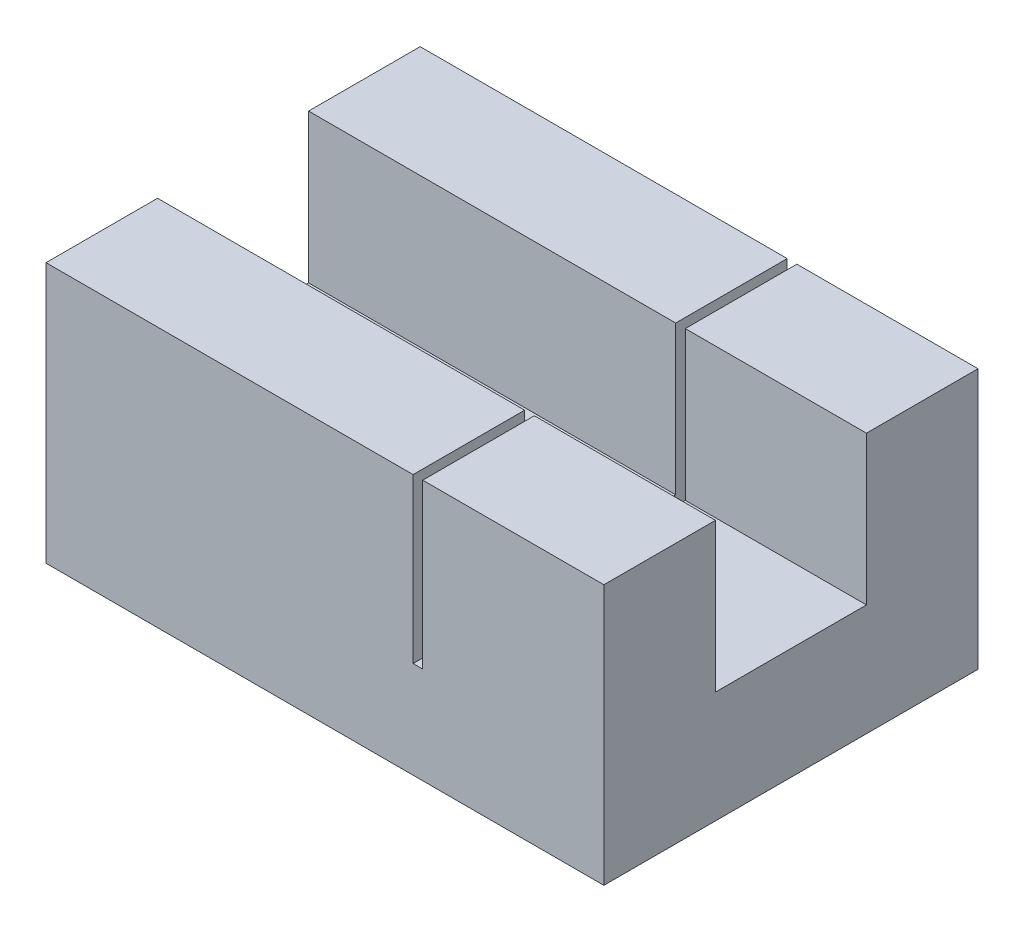
ISO-10303-21;
HEADER;
FILE_DESCRIPTION(('STEP AP214'),'2;1');
FILE_NAME('part.step','',(''),(''),'','','');
FILE_SCHEMA(('AUTOMOTIVE_DESIGN { 1 0 10303 214 1 1 1 1 }'));
ENDSEC;
DATA;
#1=APPLICATION_CONTEXT('core data for automotive mechanical design processes');
#2=APPLICATION_PROTOCOL_DEFINITION('international standard','automotive_design',2000,#1);
#3=PRODUCT_CONTEXT('',#1,'mechanical');
#4=PRODUCT('Part','Part','',(#3));
#5=PRODUCT_RELATED_PRODUCT_CATEGORY('part','',(#4));
#6=PRODUCT_DEFINITION_FORMATION('','',#4);
#7=PRODUCT_DEFINITION_CONTEXT('part definition',#1,'design');
#8=PRODUCT_DEFINITION('design','',#6,#7);
#9=PRODUCT_DEFINITION_SHAPE('','',#8);
#10=(LENGTH_UNIT() NAMED_UNIT(*) SI_UNIT(.MILLI.,.METRE.));
#11=(NAMED_UNIT(*) PLANE_ANGLE_UNIT() SI_UNIT($,.RADIAN.));
#12=(NAMED_UNIT(*) SI_UNIT($,.STERADIAN.) SOLID_ANGLE_UNIT());
#13=UNCERTAINTY_MEASURE_WITH_UNIT(LENGTH_MEASURE(1.E-05),#10,'distance_accuracy_value','');
#14=(GEOMETRIC_REPRESENTATION_CONTEXT(3) GLOBAL_UNCERTAINTY_ASSIGNED_CONTEXT((#13)) GLOBAL_UNIT_ASSIGNED_CONTEXT((#10,
#11,#12)) REPRESENTATION_CONTEXT('',''));
#15=CARTESIAN_POINT('',(0.,0.,0.));
#16=DIRECTION('',(0.,0.,1.));
#17=DIRECTION('',(1.,0.,0.));
#18=AXIS2_PLACEMENT_3D('',#15,#16,#17);
#19=CARTESIAN_POINT('',(0.,15.,0.));
#20=DIRECTION('',(0.,-1.,0.));
#21=DIRECTION('',(0.,0.,-1.));
#22=AXIS2_PLACEMENT_3D('',#19,#20,#21);
#23=PLANE('',#22);
#24=DIRECTION('',(-1.,0.,0.));
#25=VECTOR('',#24,1.);
#26=CARTESIAN_POINT('',(0.,15.,-20.3));
#27=LINE('',#26,#25);
#28=CARTESIAN_POINT('',(50.,15.,-20.3));
#29=VERTEX_POINT('',#28);
#30=CARTESIAN_POINT('',(25.65,15.,-20.3));
#31=VERTEX_POINT('',#30);
#32=EDGE_CURVE('E12',#29,#31,#27,.T.);
#33=ORIENTED_EDGE('',*,*,#32,.T.);
#34=DIRECTION('',(0.,0.,1.));
#35=VECTOR('',#34,1.);
#36=CARTESIAN_POINT('',(25.65,15.,0.));
#37=LINE('',#36,#35);
#38=CARTESIAN_POINT('',(25.65,15.,0.));
#39=VERTEX_POINT('',#38);
#40=EDGE_CURVE('E258',#31,#39,#37,.T.);
#41=ORIENTED_EDGE('',*,*,#40,.T.);
#42=DIRECTION('',(1.,0.,0.));
#43=VECTOR('',#42,1.);
#44=CARTESIAN_POINT('',(0.,15.,0.));
#45=LINE('',#44,#43);
#46=CARTESIAN_POINT('',(50.,15.,0.));
#47=VERTEX_POINT('',#46);
#48=EDGE_CURVE('E66',#39,#47,#45,.T.);
#49=ORIENTED_EDGE('',*,*,#48,.T.);
#50=DIRECTION('',(0.,0.,-1.));
#51=VECTOR('',#50,1.);
#52=CARTESIAN_POINT('',(50.,15.,0.));
#53=LINE('',#52,#51);
#54=EDGE_CURVE('E308',#47,#29,#53,.T.);
#55=ORIENTED_EDGE('',*,*,#54,.T.);
#56=EDGE_LOOP('',(#33,#41,#49,#55));
#57=FACE_BOUND('',#56,.T.);
#58=ADVANCED_FACE('F41',(#57),#23,.F.);
#59=CARTESIAN_POINT('',(0.,0.,0.));
#60=DIRECTION('',(0.,0.,-1.));
#61=DIRECTION('',(-1.,0.,0.));
#62=AXIS2_PLACEMENT_3D('',#59,#60,#61);
#63=PLANE('',#62);
#64=DIRECTION('',(0.,-1.,0.));
#65=VECTOR('',#64,1.);
#66=CARTESIAN_POINT('',(25.65,0.,0.));
#67=LINE('',#66,#65);
#68=CARTESIAN_POINT('',(25.65,35.,0.));
#69=VERTEX_POINT('',#68);
#70=EDGE_CURVE('E261',#69,#39,#67,.T.);
#71=ORIENTED_EDGE('',*,*,#70,.F.);
#72=DIRECTION('',(-1.,0.,0.));
#73=VECTOR('',#72,1.);
#74=CARTESIAN_POINT('',(0.,35.,0.));
#75=LINE('',#74,#73);
#76=CARTESIAN_POINT('',(50.,35.,0.));
#77=VERTEX_POINT('',#76);
#78=EDGE_CURVE('E286',#77,#69,#75,.T.);
#79=ORIENTED_EDGE('',*,*,#78,.F.);
#80=DIRECTION('',(0.,1.,0.));
#81=VECTOR('',#80,1.);
#82=CARTESIAN_POINT('',(50.,0.,0.));
#83=LINE('',#82,#81);
#84=EDGE_CURVE('E282',#47,#77,#83,.T.);
#85=ORIENTED_EDGE('',*,*,#84,.F.);
#86=ORIENTED_EDGE('',*,*,#48,.F.);
#87=EDGE_LOOP('',(#71,#79,#85,#86));
#88=FACE_BOUND('',#87,.T.);
#89=ADVANCED_FACE('F357',(#88),#63,.T.);
#90=CARTESIAN_POINT('',(0.,35.,15.));
#91=DIRECTION('',(0.,-1.,0.));
#92=DIRECTION('',(0.,0.,-1.));
#93=AXIS2_PLACEMENT_3D('',#90,#91,#92);
#94=PLANE('',#93);
#95=ORIENTED_EDGE('',*,*,#78,.T.);
#96=DIRECTION('',(0.,0.,-1.));
#97=VECTOR('',#96,1.);
#98=CARTESIAN_POINT('',(25.65,35.,-35.3));
#99=LINE('',#98,#97);
#100=CARTESIAN_POINT('',(25.65,35.,15.));
#101=VERTEX_POINT('',#100);
#102=EDGE_CURVE('E212',#101,#69,#99,.T.);
#103=ORIENTED_EDGE('',*,*,#102,.F.);
#104=DIRECTION('',(-1.,0.,0.));
#105=VECTOR('',#104,1.);
#106=CARTESIAN_POINT('',(0.,35.,15.));
#107=LINE('',#106,#105);
#108=CARTESIAN_POINT('',(50.,35.,15.));
#109=VERTEX_POINT('',#108);
#110=EDGE_CURVE('E290',#109,#101,#107,.T.);
#111=ORIENTED_EDGE('',*,*,#110,.F.);
#112=DIRECTION('',(0.,0.,-1.));
#113=VECTOR('',#112,1.);
#114=CARTESIAN_POINT('',(50.,35.,15.));
#115=LINE('',#114,#113);
#116=EDGE_CURVE('E294',#109,#77,#115,.T.);
#117=ORIENTED_EDGE('',*,*,#116,.T.);
#118=EDGE_LOOP('',(#95,#103,#111,#117));
#119=FACE_BOUND('',#118,.T.);
#120=ADVANCED_FACE('F353',(#119),#94,.F.);
#121=CARTESIAN_POINT('',(0.,0.,-20.3));
#122=DIRECTION('',(0.,0.,1.));
#123=DIRECTION('',(-1.,0.,0.));
#124=AXIS2_PLACEMENT_3D('',#121,#122,#123);
#125=PLANE('',#124);
#126=DIRECTION('',(0.,1.,0.));
#127=VECTOR('',#126,1.);
#128=CARTESIAN_POINT('',(25.65,0.,-20.3));
#129=LINE('',#128,#127);
#130=CARTESIAN_POINT('',(25.65,35.,-20.3));
#131=VERTEX_POINT('',#130);
#132=EDGE_CURVE('E255',#31,#131,#129,.T.);
#133=ORIENTED_EDGE('',*,*,#132,.F.);
#134=ORIENTED_EDGE('',*,*,#32,.F.);
#135=DIRECTION('',(0.,1.,0.));
#136=VECTOR('',#135,1.);
#137=CARTESIAN_POINT('',(50.,0.,-20.3));
#138=LINE('',#137,#136);
#139=CARTESIAN_POINT('',(50.,35.,-20.3));
#140=VERTEX_POINT('',#139);
#141=EDGE_CURVE('E276',#29,#140,#138,.T.);
#142=ORIENTED_EDGE('',*,*,#141,.T.);
#143=DIRECTION('',(-1.,0.,0.));
#144=VECTOR('',#143,1.);
#145=CARTESIAN_POINT('',(0.,35.,-20.3));
#146=LINE('',#145,#144);
#147=EDGE_CURVE('E272',#140,#131,#146,.T.);
#148=ORIENTED_EDGE('',*,*,#147,.T.);
#149=EDGE_LOOP('',(#133,#134,#142,#148));
#150=FACE_BOUND('',#149,.T.);
#151=ADVANCED_FACE('F361',(#150),#125,.T.);
#152=CARTESIAN_POINT('',(0.,35.,-35.3));
#153=DIRECTION('',(0.,1.,0.));
#154=DIRECTION('',(0.,0.,1.));
#155=AXIS2_PLACEMENT_3D('',#152,#153,#154);
#156=PLANE('',#155);
#157=CARTESIAN_POINT('',(25.65,35.,-35.3));
#158=VERTEX_POINT('',#157);
#159=EDGE_CURVE('E216',#131,#158,#99,.T.);
#160=ORIENTED_EDGE('',*,*,#159,.F.);
#161=ORIENTED_EDGE('',*,*,#147,.F.);
#162=DIRECTION('',(0.,0.,1.));
#163=VECTOR('',#162,1.);
#164=CARTESIAN_POINT('',(50.,35.,-35.3));
#165=LINE('',#164,#163);
#166=CARTESIAN_POINT('',(50.,35.,-35.3));
#167=VERTEX_POINT('',#166);
#168=EDGE_CURVE('E171',#167,#140,#165,.T.);
#169=ORIENTED_EDGE('',*,*,#168,.F.);
#170=DIRECTION('',(-1.,0.,0.));
#171=VECTOR('',#170,1.);
#172=CARTESIAN_POINT('',(0.,35.,-35.3));
#173=LINE('',#172,#171);
#174=EDGE_CURVE('E265',#167,#158,#173,.T.);
#175=ORIENTED_EDGE('',*,*,#174,.T.);
#176=EDGE_LOOP('',(#160,#161,#169,#175));
#177=FACE_BOUND('',#176,.T.);
#178=ADVANCED_FACE('F366',(#177),#156,.T.);
#179=CARTESIAN_POINT('',(50.,15.,0.));
#180=DIRECTION('',(-1.,0.,0.));
#181=DIRECTION('',(0.,0.,1.));
#182=AXIS2_PLACEMENT_3D('',#179,#180,#181);
#183=PLANE('',#182);
#184=DIRECTION('',(0.,0.,-1.));
#185=VECTOR('',#184,1.);
#186=CARTESIAN_POINT('',(50.,0.,0.));
#187=LINE('',#186,#185);
#188=CARTESIAN_POINT('',(50.,0.,15.));
#189=VERTEX_POINT('',#188);
#190=CARTESIAN_POINT('',(50.,0.,-35.3));
#191=VERTEX_POINT('',#190);
#192=EDGE_CURVE('E45',#189,#191,#187,.T.);
#193=ORIENTED_EDGE('',*,*,#192,.T.);
#194=DIRECTION('',(0.,1.,0.));
#195=VECTOR('',#194,1.);
#196=CARTESIAN_POINT('',(50.,0.,-35.3));
#197=LINE('',#196,#195);
#198=EDGE_CURVE('E168',#191,#167,#197,.T.);
#199=ORIENTED_EDGE('',*,*,#198,.T.);
#200=ORIENTED_EDGE('',*,*,#168,.T.);
#201=ORIENTED_EDGE('',*,*,#141,.F.);
#202=ORIENTED_EDGE('',*,*,#54,.F.);
#203=ORIENTED_EDGE('',*,*,#84,.T.);
#204=ORIENTED_EDGE('',*,*,#116,.F.);
#205=DIRECTION('',(0.,1.,0.));
#206=VECTOR('',#205,1.);
#207=CARTESIAN_POINT('',(50.,0.,15.));
#208=LINE('',#207,#206);
#209=EDGE_CURVE('E285',#189,#109,#208,.T.);
#210=ORIENTED_EDGE('',*,*,#209,.F.);
#211=EDGE_LOOP('',(#193,#199,#200,#201,#202,#203,#204,#210));
#212=FACE_BOUND('',#211,.T.);
#213=ADVANCED_FACE('F43',(#212),#183,.F.);
#214=CARTESIAN_POINT('',(-25.,15.,0.));
#215=VERTEX_POINT('',#214);
#216=CARTESIAN_POINT('',(24.35,15.,0.));
#217=VERTEX_POINT('',#216);
#218=EDGE_CURVE('E304',#215,#217,#45,.T.);
#219=ORIENTED_EDGE('',*,*,#218,.T.);
#220=DIRECTION('',(0.,0.,-1.));
#221=VECTOR('',#220,1.);
#222=CARTESIAN_POINT('',(24.35,15.,0.));
#223=LINE('',#222,#221);
#224=CARTESIAN_POINT('',(24.35,15.,-20.3));
#225=VERTEX_POINT('',#224);
#226=EDGE_CURVE('E248',#217,#225,#223,.T.);
#227=ORIENTED_EDGE('',*,*,#226,.T.);
#228=CARTESIAN_POINT('',(-25.,15.,-20.3));
#229=VERTEX_POINT('',#228);
#230=EDGE_CURVE('E51',#225,#229,#27,.T.);
#231=ORIENTED_EDGE('',*,*,#230,.T.);
#232=DIRECTION('',(0.,0.,-1.));
#233=VECTOR('',#232,1.);
#234=CARTESIAN_POINT('',(-25.,15.,0.));
#235=LINE('',#234,#233);
#236=EDGE_CURVE('E202',#215,#229,#235,.T.);
#237=ORIENTED_EDGE('',*,*,#236,.F.);
#238=EDGE_LOOP('',(#219,#227,#231,#237));
#239=FACE_BOUND('',#238,.T.);
#240=ADVANCED_FACE('F315',(#239),#23,.F.);
#241=CARTESIAN_POINT('',(0.,0.,0.));
#242=DIRECTION('',(0.,-1.,0.));
#243=DIRECTION('',(0.,0.,-1.));
#244=AXIS2_PLACEMENT_3D('',#241,#242,#243);
#245=PLANE('',#244);
#246=DIRECTION('',(1.,0.,0.));
#247=VECTOR('',#246,1.);
#248=CARTESIAN_POINT('',(0.,0.,15.));
#249=LINE('',#248,#247);
#250=CARTESIAN_POINT('',(-25.,0.,15.));
#251=VERTEX_POINT('',#250);
#252=EDGE_CURVE('E177',#251,#189,#249,.T.);
#253=ORIENTED_EDGE('',*,*,#252,.F.);
#254=DIRECTION('',(0.,0.,1.));
#255=VECTOR('',#254,1.);
#256=CARTESIAN_POINT('',(-25.,0.,-35.3));
#257=LINE('',#256,#255);
#258=CARTESIAN_POINT('',(-25.,0.,-35.3));
#259=VERTEX_POINT('',#258);
#260=EDGE_CURVE('E174',#259,#251,#257,.T.);
#261=ORIENTED_EDGE('',*,*,#260,.F.);
#262=DIRECTION('',(1.,0.,0.));
#263=VECTOR('',#262,1.);
#264=CARTESIAN_POINT('',(0.,0.,-35.3));
#265=LINE('',#264,#263);
#266=EDGE_CURVE('E160',#259,#191,#265,.T.);
#267=ORIENTED_EDGE('',*,*,#266,.T.);
#268=ORIENTED_EDGE('',*,*,#192,.F.);
#269=EDGE_LOOP('',(#253,#261,#267,#268));
#270=FACE_BOUND('',#269,.T.);
#271=ADVANCED_FACE('F175',(#270),#245,.T.);
#272=DIRECTION('',(0.,1.,0.));
#273=VECTOR('',#272,1.);
#274=CARTESIAN_POINT('',(24.35,0.,0.));
#275=LINE('',#274,#273);
#276=CARTESIAN_POINT('',(24.35,35.,0.));
#277=VERTEX_POINT('',#276);
#278=EDGE_CURVE('E252',#217,#277,#275,.T.);
#279=ORIENTED_EDGE('',*,*,#278,.F.);
#280=ORIENTED_EDGE('',*,*,#218,.F.);
#281=DIRECTION('',(0.,-1.,0.));
#282=VECTOR('',#281,1.);
#283=CARTESIAN_POINT('',(-25.,35.,0.));
#284=LINE('',#283,#282);
#285=CARTESIAN_POINT('',(-25.,35.,0.));
#286=VERTEX_POINT('',#285);
#287=EDGE_CURVE('E198',#286,#215,#284,.T.);
#288=ORIENTED_EDGE('',*,*,#287,.F.);
#289=EDGE_CURVE('E297',#277,#286,#75,.T.);
#290=ORIENTED_EDGE('',*,*,#289,.F.);
#291=EDGE_LOOP('',(#279,#280,#288,#290));
#292=FACE_BOUND('',#291,.T.);
#293=ADVANCED_FACE('F382',(#292),#63,.T.);
#294=CARTESIAN_POINT('',(24.35,35.,15.));
#295=VERTEX_POINT('',#294);
#296=CARTESIAN_POINT('',(-25.,35.,15.));
#297=VERTEX_POINT('',#296);
#298=EDGE_CURVE('E289',#295,#297,#107,.T.);
#299=ORIENTED_EDGE('',*,*,#298,.F.);
#300=DIRECTION('',(0.,0.,1.));
#301=VECTOR('',#300,1.);
#302=CARTESIAN_POINT('',(24.35,35.,-35.3));
#303=LINE('',#302,#301);
#304=EDGE_CURVE('E211',#277,#295,#303,.T.);
#305=ORIENTED_EDGE('',*,*,#304,.F.);
#306=ORIENTED_EDGE('',*,*,#289,.T.);
#307=DIRECTION('',(0.,0.,-1.));
#308=VECTOR('',#307,1.);
#309=CARTESIAN_POINT('',(-25.,35.,15.));
#310=LINE('',#309,#308);
#311=EDGE_CURVE('E194',#297,#286,#310,.T.);
#312=ORIENTED_EDGE('',*,*,#311,.F.);
#313=EDGE_LOOP('',(#299,#305,#306,#312));
#314=FACE_BOUND('',#313,.T.);
#315=ADVANCED_FACE('F340',(#314),#94,.F.);
#316=CARTESIAN_POINT('',(0.,0.,15.));
#317=DIRECTION('',(0.,0.,-1.));
#318=DIRECTION('',(-1.,0.,0.));
#319=AXIS2_PLACEMENT_3D('',#316,#317,#318);
#320=PLANE('',#319);
#321=ORIENTED_EDGE('',*,*,#110,.T.);
#322=DIRECTION('',(0.,1.,0.));
#323=VECTOR('',#322,1.);
#324=CARTESIAN_POINT('',(25.65,-50.3167964004069,15.));
#325=LINE('',#324,#323);
#326=CARTESIAN_POINT('',(25.65,13.,15.));
#327=VERTEX_POINT('',#326);
#328=EDGE_CURVE('E223',#327,#101,#325,.T.);
#329=ORIENTED_EDGE('',*,*,#328,.F.);
#330=DIRECTION('',(1.,0.,0.));
#331=VECTOR('',#330,1.);
#332=CARTESIAN_POINT('',(24.35,13.,15.));
#333=LINE('',#332,#331);
#334=CARTESIAN_POINT('',(24.35,13.,15.));
#335=VERTEX_POINT('',#334);
#336=EDGE_CURVE('E215',#335,#327,#333,.T.);
#337=ORIENTED_EDGE('',*,*,#336,.F.);
#338=DIRECTION('',(0.,1.,0.));
#339=VECTOR('',#338,1.);
#340=CARTESIAN_POINT('',(24.35,-50.3167964004069,15.));
#341=LINE('',#340,#339);
#342=EDGE_CURVE('E227',#335,#295,#341,.T.);
#343=ORIENTED_EDGE('',*,*,#342,.T.);
#344=ORIENTED_EDGE('',*,*,#298,.T.);
#345=DIRECTION('',(0.,1.,0.));
#346=VECTOR('',#345,1.);
#347=CARTESIAN_POINT('',(-25.,0.,15.));
#348=LINE('',#347,#346);
#349=EDGE_CURVE('E182',#251,#297,#348,.T.);
#350=ORIENTED_EDGE('',*,*,#349,.F.);
#351=ORIENTED_EDGE('',*,*,#252,.T.);
#352=ORIENTED_EDGE('',*,*,#209,.T.);
#353=EDGE_LOOP('',(#321,#329,#337,#343,#344,#350,#351,#352));
#354=FACE_BOUND('',#353,.T.);
#355=ADVANCED_FACE('F337',(#354),#320,.F.);
#356=DIRECTION('',(0.,-1.,0.));
#357=VECTOR('',#356,1.);
#358=CARTESIAN_POINT('',(24.35,0.,-20.3));
#359=LINE('',#358,#357);
#360=CARTESIAN_POINT('',(24.35,35.,-20.3));
#361=VERTEX_POINT('',#360);
#362=EDGE_CURVE('E245',#361,#225,#359,.T.);
#363=ORIENTED_EDGE('',*,*,#362,.F.);
#364=CARTESIAN_POINT('',(-25.,35.,-20.3));
#365=VERTEX_POINT('',#364);
#366=EDGE_CURVE('E264',#361,#365,#146,.T.);
#367=ORIENTED_EDGE('',*,*,#366,.T.);
#368=DIRECTION('',(0.,1.,0.));
#369=VECTOR('',#368,1.);
#370=CARTESIAN_POINT('',(-25.,15.,-20.3));
#371=LINE('',#370,#369);
#372=EDGE_CURVE('E206',#229,#365,#371,.T.);
#373=ORIENTED_EDGE('',*,*,#372,.F.);
#374=ORIENTED_EDGE('',*,*,#230,.F.);
#375=EDGE_LOOP('',(#363,#367,#373,#374));
#376=FACE_BOUND('',#375,.T.);
#377=ADVANCED_FACE('F320',(#376),#125,.T.);
#378=CARTESIAN_POINT('',(24.35,35.,-35.3));
#379=VERTEX_POINT('',#378);
#380=EDGE_CURVE('E217',#379,#361,#303,.T.);
#381=ORIENTED_EDGE('',*,*,#380,.F.);
#382=CARTESIAN_POINT('',(-25.,35.,-35.3));
#383=VERTEX_POINT('',#382);
#384=EDGE_CURVE('E269',#379,#383,#173,.T.);
#385=ORIENTED_EDGE('',*,*,#384,.T.);
#386=DIRECTION('',(0.,0.,-1.));
#387=VECTOR('',#386,1.);
#388=CARTESIAN_POINT('',(-25.,35.,-20.3));
#389=LINE('',#388,#387);
#390=EDGE_CURVE('E188',#365,#383,#389,.T.);
#391=ORIENTED_EDGE('',*,*,#390,.F.);
#392=ORIENTED_EDGE('',*,*,#366,.F.);
#393=EDGE_LOOP('',(#381,#385,#391,#392));
#394=FACE_BOUND('',#393,.T.);
#395=ADVANCED_FACE('F344',(#394),#156,.T.);
#396=CARTESIAN_POINT('',(0.,0.,-35.3));
#397=DIRECTION('',(0.,0.,1.));
#398=DIRECTION('',(-1.,0.,0.));
#399=AXIS2_PLACEMENT_3D('',#396,#397,#398);
#400=PLANE('',#399);
#401=DIRECTION('',(-1.,0.,0.));
#402=VECTOR('',#401,1.);
#403=CARTESIAN_POINT('',(24.35,13.,-35.3));
#404=LINE('',#403,#402);
#405=CARTESIAN_POINT('',(25.65,13.,-35.3));
#406=VERTEX_POINT('',#405);
#407=CARTESIAN_POINT('',(24.35,13.,-35.3));
#408=VERTEX_POINT('',#407);
#409=EDGE_CURVE('E58',#406,#408,#404,.T.);
#410=ORIENTED_EDGE('',*,*,#409,.F.);
#411=DIRECTION('',(0.,1.,0.));
#412=VECTOR('',#411,1.);
#413=CARTESIAN_POINT('',(25.65,-50.3167964004069,-35.3));
#414=LINE('',#413,#412);
#415=EDGE_CURVE('E231',#406,#158,#414,.T.);
#416=ORIENTED_EDGE('',*,*,#415,.T.);
#417=ORIENTED_EDGE('',*,*,#174,.F.);
#418=ORIENTED_EDGE('',*,*,#198,.F.);
#419=ORIENTED_EDGE('',*,*,#266,.F.);
#420=DIRECTION('',(0.,-1.,0.));
#421=VECTOR('',#420,1.);
#422=CARTESIAN_POINT('',(-25.,35.,-35.3));
#423=LINE('',#422,#421);
#424=EDGE_CURVE('E165',#383,#259,#423,.T.);
#425=ORIENTED_EDGE('',*,*,#424,.F.);
#426=ORIENTED_EDGE('',*,*,#384,.F.);
#427=DIRECTION('',(0.,1.,0.));
#428=VECTOR('',#427,1.);
#429=CARTESIAN_POINT('',(24.35,-50.3167964004069,-35.3));
#430=LINE('',#429,#428);
#431=EDGE_CURVE('E228',#408,#379,#430,.T.);
#432=ORIENTED_EDGE('',*,*,#431,.F.);
#433=EDGE_LOOP('',(#410,#416,#417,#418,#419,#425,#426,#432));
#434=FACE_BOUND('',#433,.T.);
#435=ADVANCED_FACE('F162',(#434),#400,.F.);
#436=CARTESIAN_POINT('',(0.,13.,0.));
#437=DIRECTION('',(0.,-1.,0.));
#438=DIRECTION('',(0.,0.,-1.));
#439=AXIS2_PLACEMENT_3D('',#436,#437,#438);
#440=PLANE('',#439);
#441=DIRECTION('',(0.,0.,1.));
#442=VECTOR('',#441,1.);
#443=CARTESIAN_POINT('',(24.35,13.,-35.3));
#444=LINE('',#443,#442);
#445=EDGE_CURVE('E224',#408,#335,#444,.T.);
#446=ORIENTED_EDGE('',*,*,#445,.T.);
#447=ORIENTED_EDGE('',*,*,#336,.T.);
#448=DIRECTION('',(0.,0.,-1.));
#449=VECTOR('',#448,1.);
#450=CARTESIAN_POINT('',(25.65,13.,-35.3));
#451=LINE('',#450,#449);
#452=EDGE_CURVE('E232',#327,#406,#451,.T.);
#453=ORIENTED_EDGE('',*,*,#452,.T.);
#454=ORIENTED_EDGE('',*,*,#409,.T.);
#455=EDGE_LOOP('',(#446,#447,#453,#454));
#456=FACE_BOUND('',#455,.T.);
#457=ADVANCED_FACE('F346',(#456),#440,.F.);
#458=CARTESIAN_POINT('',(25.65,-50.3167964004069,-35.3));
#459=DIRECTION('',(1.,0.,0.));
#460=DIRECTION('',(0.,0.,-1.));
#461=AXIS2_PLACEMENT_3D('',#458,#459,#460);
#462=PLANE('',#461);
#463=ORIENTED_EDGE('',*,*,#70,.T.);
#464=ORIENTED_EDGE('',*,*,#40,.F.);
#465=ORIENTED_EDGE('',*,*,#132,.T.);
#466=ORIENTED_EDGE('',*,*,#159,.T.);
#467=ORIENTED_EDGE('',*,*,#415,.F.);
#468=ORIENTED_EDGE('',*,*,#452,.F.);
#469=ORIENTED_EDGE('',*,*,#328,.T.);
#470=ORIENTED_EDGE('',*,*,#102,.T.);
#471=EDGE_LOOP('',(#463,#464,#465,#466,#467,#468,#469,#470));
#472=FACE_BOUND('',#471,.T.);
#473=ADVANCED_FACE('F350',(#472),#462,.F.);
#474=CARTESIAN_POINT('',(24.35,-50.3167964004069,-35.3));
#475=DIRECTION('',(-1.,0.,0.));
#476=DIRECTION('',(0.,0.,1.));
#477=AXIS2_PLACEMENT_3D('',#474,#475,#476);
#478=PLANE('',#477);
#479=ORIENTED_EDGE('',*,*,#278,.T.);
#480=ORIENTED_EDGE('',*,*,#304,.T.);
#481=ORIENTED_EDGE('',*,*,#342,.F.);
#482=ORIENTED_EDGE('',*,*,#445,.F.);
#483=ORIENTED_EDGE('',*,*,#431,.T.);
#484=ORIENTED_EDGE('',*,*,#380,.T.);
#485=ORIENTED_EDGE('',*,*,#362,.T.);
#486=ORIENTED_EDGE('',*,*,#226,.F.);
#487=EDGE_LOOP('',(#479,#480,#481,#482,#483,#484,#485,#486));
#488=FACE_BOUND('',#487,.T.);
#489=ADVANCED_FACE('F330',(#488),#478,.F.);
#490=CARTESIAN_POINT('',(-25.,0.,0.));
#491=DIRECTION('',(-1.,0.,0.));
#492=DIRECTION('',(0.,0.,1.));
#493=AXIS2_PLACEMENT_3D('',#490,#491,#492);
#494=PLANE('',#493);
#495=ORIENTED_EDGE('',*,*,#424,.T.);
#496=ORIENTED_EDGE('',*,*,#260,.T.);
#497=ORIENTED_EDGE('',*,*,#349,.T.);
#498=ORIENTED_EDGE('',*,*,#311,.T.);
#499=ORIENTED_EDGE('',*,*,#287,.T.);
#500=ORIENTED_EDGE('',*,*,#236,.T.);
#501=ORIENTED_EDGE('',*,*,#372,.T.);
#502=ORIENTED_EDGE('',*,*,#390,.T.);
#503=EDGE_LOOP('',(#495,#496,#497,#498,#499,#500,#501,#502));
#504=FACE_BOUND('',#503,.T.);
#505=ADVANCED_FACE('F185',(#504),#494,.T.);
#506=CLOSED_SHELL('',(#58,#89,#120,#151,#178,#213,#240,#271,#293,#315,#355,#377,#395,#435,#457,
#473,#489,#505));
#507=MANIFOLD_SOLID_BREP('B2',#506);
#508=ADVANCED_BREP_SHAPE_REPRESENTATION('',(#18,#507),#14);
#509=SHAPE_DEFINITION_REPRESENTATION(#9,#508);
ENDSEC;
END-ISO-10303-21;
